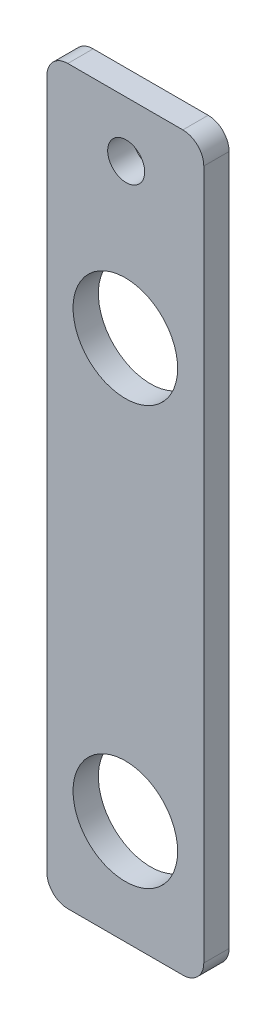
ISO-10303-21;
HEADER;
FILE_DESCRIPTION(('STEP AP214'),'2;1');
FILE_NAME('part.step','',(''),(''),'','','');
FILE_SCHEMA(('AUTOMOTIVE_DESIGN { 1 0 10303 214 1 1 1 1 }'));
ENDSEC;
DATA;
#1=APPLICATION_CONTEXT('core data for automotive mechanical design processes');
#2=APPLICATION_PROTOCOL_DEFINITION('international standard','automotive_design',2000,#1);
#3=PRODUCT_CONTEXT('',#1,'mechanical');
#4=PRODUCT('Part','Part','',(#3));
#5=PRODUCT_RELATED_PRODUCT_CATEGORY('part','',(#4));
#6=PRODUCT_DEFINITION_FORMATION('','',#4);
#7=PRODUCT_DEFINITION_CONTEXT('part definition',#1,'design');
#8=PRODUCT_DEFINITION('design','',#6,#7);
#9=PRODUCT_DEFINITION_SHAPE('','',#8);
#10=(LENGTH_UNIT() NAMED_UNIT(*) SI_UNIT(.MILLI.,.METRE.));
#11=(NAMED_UNIT(*) PLANE_ANGLE_UNIT() SI_UNIT($,.RADIAN.));
#12=(NAMED_UNIT(*) SI_UNIT($,.STERADIAN.) SOLID_ANGLE_UNIT());
#13=UNCERTAINTY_MEASURE_WITH_UNIT(LENGTH_MEASURE(1.E-05),#10,'distance_accuracy_value','');
#14=(GEOMETRIC_REPRESENTATION_CONTEXT(3) GLOBAL_UNCERTAINTY_ASSIGNED_CONTEXT((#13)) GLOBAL_UNIT_ASSIGNED_CONTEXT((#10,
#11,#12)) REPRESENTATION_CONTEXT('',''));
#15=CARTESIAN_POINT('',(0.,0.,0.));
#16=DIRECTION('',(0.,0.,1.));
#17=DIRECTION('',(1.,0.,0.));
#18=AXIS2_PLACEMENT_3D('',#15,#16,#17);
#19=CARTESIAN_POINT('',(0.,0.,3.0734));
#20=DIRECTION('',(0.,0.,-1.));
#21=DIRECTION('',(-1.,0.,0.));
#22=AXIS2_PLACEMENT_3D('',#19,#20,#21);
#23=PLANE('',#22);
#24=CARTESIAN_POINT('',(9.62745805929899,82.1563,3.0734));
#25=DIRECTION('',(0.,0.,1.));
#26=DIRECTION('',(1.,0.,0.));
#27=AXIS2_PLACEMENT_3D('',#24,#25,#26);
#28=CIRCLE('',#27,2.2479);
#29=CARTESIAN_POINT('',(11.875358059299,82.1563,3.0734));
#30=VERTEX_POINT('',#29);
#31=EDGE_CURVE('E193',#30,#30,#28,.T.);
#32=ORIENTED_EDGE('',*,*,#31,.F.);
#33=EDGE_LOOP('',(#32));
#34=FACE_BOUND('',#33,.T.);
#35=DIRECTION('',(0.,-1.,0.));
#36=VECTOR('',#35,1.);
#37=CARTESIAN_POINT('',(0.,0.,3.0734));
#38=LINE('',#37,#36);
#39=CARTESIAN_POINT('',(0.,86.36,3.0734));
#40=VERTEX_POINT('',#39);
#41=CARTESIAN_POINT('',(0.,2.54,3.0734));
#42=VERTEX_POINT('',#41);
#43=EDGE_CURVE('E139',#40,#42,#38,.T.);
#44=ORIENTED_EDGE('',*,*,#43,.T.);
#45=CARTESIAN_POINT('',(2.54,2.54,3.0734));
#46=DIRECTION('',(0.,0.,-1.));
#47=DIRECTION('',(-1.,0.,0.));
#48=AXIS2_PLACEMENT_3D('',#45,#46,#47);
#49=CIRCLE('',#48,2.54);
#50=CARTESIAN_POINT('',(2.54,0.,3.0734));
#51=VERTEX_POINT('',#50);
#52=EDGE_CURVE('E154',#42,#51,#49,.F.);
#53=ORIENTED_EDGE('',*,*,#52,.T.);
#54=DIRECTION('',(1.,0.,0.));
#55=VECTOR('',#54,1.);
#56=CARTESIAN_POINT('',(0.,0.,3.0734));
#57=LINE('',#56,#55);
#58=CARTESIAN_POINT('',(16.51,0.,3.0734));
#59=VERTEX_POINT('',#58);
#60=EDGE_CURVE('E121',#51,#59,#57,.T.);
#61=ORIENTED_EDGE('',*,*,#60,.T.);
#62=CARTESIAN_POINT('',(16.51,2.54,3.0734));
#63=DIRECTION('',(0.,0.,-1.));
#64=DIRECTION('',(-1.,0.,0.));
#65=AXIS2_PLACEMENT_3D('',#62,#63,#64);
#66=CIRCLE('',#65,2.54);
#67=CARTESIAN_POINT('',(19.05,2.54,3.0734));
#68=VERTEX_POINT('',#67);
#69=EDGE_CURVE('E152',#59,#68,#66,.F.);
#70=ORIENTED_EDGE('',*,*,#69,.T.);
#71=DIRECTION('',(0.,1.,0.));
#72=VECTOR('',#71,1.);
#73=CARTESIAN_POINT('',(19.05,0.,3.0734));
#74=LINE('',#73,#72);
#75=CARTESIAN_POINT('',(19.05,86.36,3.0734));
#76=VERTEX_POINT('',#75);
#77=EDGE_CURVE('E165',#68,#76,#74,.T.);
#78=ORIENTED_EDGE('',*,*,#77,.T.);
#79=CARTESIAN_POINT('',(16.51,86.36,3.0734));
#80=DIRECTION('',(0.,0.,-1.));
#81=DIRECTION('',(-1.,0.,0.));
#82=AXIS2_PLACEMENT_3D('',#79,#80,#81);
#83=CIRCLE('',#82,2.54);
#84=CARTESIAN_POINT('',(16.51,88.9,3.0734));
#85=VERTEX_POINT('',#84);
#86=EDGE_CURVE('E56',#76,#85,#83,.F.);
#87=ORIENTED_EDGE('',*,*,#86,.T.);
#88=DIRECTION('',(-1.,0.,0.));
#89=VECTOR('',#88,1.);
#90=CARTESIAN_POINT('',(0.,88.9,3.0734));
#91=LINE('',#90,#89);
#92=CARTESIAN_POINT('',(2.54,88.9,3.0734));
#93=VERTEX_POINT('',#92);
#94=EDGE_CURVE('E140',#85,#93,#91,.T.);
#95=ORIENTED_EDGE('',*,*,#94,.T.);
#96=CARTESIAN_POINT('',(2.54,86.36,3.0734));
#97=DIRECTION('',(0.,0.,-1.));
#98=DIRECTION('',(-1.,0.,0.));
#99=AXIS2_PLACEMENT_3D('',#96,#97,#98);
#100=CIRCLE('',#99,2.54);
#101=EDGE_CURVE('E149',#93,#40,#100,.F.);
#102=ORIENTED_EDGE('',*,*,#101,.T.);
#103=EDGE_LOOP('',(#44,#53,#61,#70,#78,#87,#95,#102));
#104=FACE_BOUND('',#103,.T.);
#105=CARTESIAN_POINT('',(9.525,12.7,3.0734));
#106=DIRECTION('',(0.,0.,1.));
#107=DIRECTION('',(1.,0.,0.));
#108=AXIS2_PLACEMENT_3D('',#105,#106,#107);
#109=CIRCLE('',#108,6.35);
#110=CARTESIAN_POINT('',(15.875,12.7,3.0734));
#111=VERTEX_POINT('',#110);
#112=EDGE_CURVE('E134',#111,#111,#109,.T.);
#113=ORIENTED_EDGE('',*,*,#112,.F.);
#114=EDGE_LOOP('',(#113));
#115=FACE_BOUND('',#114,.T.);
#116=CARTESIAN_POINT('',(9.525,63.5,3.0734));
#117=DIRECTION('',(0.,0.,1.));
#118=DIRECTION('',(1.,0.,0.));
#119=AXIS2_PLACEMENT_3D('',#116,#117,#118);
#120=CIRCLE('',#119,6.35);
#121=CARTESIAN_POINT('',(15.875,63.5,3.0734));
#122=VERTEX_POINT('',#121);
#123=EDGE_CURVE('E182',#122,#122,#120,.T.);
#124=ORIENTED_EDGE('',*,*,#123,.F.);
#125=EDGE_LOOP('',(#124));
#126=FACE_BOUND('',#125,.T.);
#127=ADVANCED_FACE('F35',(#34,#104,#115,#126),#23,.F.);
#128=CARTESIAN_POINT('',(0.,0.,0.));
#129=DIRECTION('',(0.,0.,-1.));
#130=DIRECTION('',(-1.,0.,0.));
#131=AXIS2_PLACEMENT_3D('',#128,#129,#130);
#132=PLANE('',#131);
#133=CARTESIAN_POINT('',(9.62745805929899,82.1563,0.));
#134=DIRECTION('',(0.,0.,1.));
#135=DIRECTION('',(1.,0.,0.));
#136=AXIS2_PLACEMENT_3D('',#133,#134,#135);
#137=CIRCLE('',#136,2.2479);
#138=CARTESIAN_POINT('',(11.875358059299,82.1563,0.));
#139=VERTEX_POINT('',#138);
#140=EDGE_CURVE('E188',#139,#139,#137,.T.);
#141=ORIENTED_EDGE('',*,*,#140,.T.);
#142=EDGE_LOOP('',(#141));
#143=FACE_BOUND('',#142,.T.);
#144=CARTESIAN_POINT('',(9.525,12.7,0.));
#145=DIRECTION('',(0.,0.,1.));
#146=DIRECTION('',(1.,0.,0.));
#147=AXIS2_PLACEMENT_3D('',#144,#145,#146);
#148=CIRCLE('',#147,6.35);
#149=CARTESIAN_POINT('',(15.875,12.7,0.));
#150=VERTEX_POINT('',#149);
#151=EDGE_CURVE('E179',#150,#150,#148,.T.);
#152=ORIENTED_EDGE('',*,*,#151,.T.);
#153=EDGE_LOOP('',(#152));
#154=FACE_BOUND('',#153,.T.);
#155=DIRECTION('',(1.,0.,0.));
#156=VECTOR('',#155,1.);
#157=CARTESIAN_POINT('',(0.,0.,0.));
#158=LINE('',#157,#156);
#159=CARTESIAN_POINT('',(2.54,0.,0.));
#160=VERTEX_POINT('',#159);
#161=CARTESIAN_POINT('',(16.51,0.,0.));
#162=VERTEX_POINT('',#161);
#163=EDGE_CURVE('E118',#160,#162,#158,.T.);
#164=ORIENTED_EDGE('',*,*,#163,.F.);
#165=CARTESIAN_POINT('',(2.54,2.54,0.));
#166=DIRECTION('',(0.,0.,-1.));
#167=DIRECTION('',(-1.,0.,0.));
#168=AXIS2_PLACEMENT_3D('',#165,#166,#167);
#169=CIRCLE('',#168,2.54);
#170=CARTESIAN_POINT('',(0.,2.54,0.));
#171=VERTEX_POINT('',#170);
#172=EDGE_CURVE('E101',#160,#171,#169,.T.);
#173=ORIENTED_EDGE('',*,*,#172,.T.);
#174=DIRECTION('',(0.,-1.,0.));
#175=VECTOR('',#174,1.);
#176=CARTESIAN_POINT('',(0.,0.,0.));
#177=LINE('',#176,#175);
#178=CARTESIAN_POINT('',(0.,86.36,0.));
#179=VERTEX_POINT('',#178);
#180=EDGE_CURVE('E129',#179,#171,#177,.T.);
#181=ORIENTED_EDGE('',*,*,#180,.F.);
#182=CARTESIAN_POINT('',(2.54,86.36,0.));
#183=DIRECTION('',(0.,0.,-1.));
#184=DIRECTION('',(-1.,0.,0.));
#185=AXIS2_PLACEMENT_3D('',#182,#183,#184);
#186=CIRCLE('',#185,2.54);
#187=CARTESIAN_POINT('',(2.54,88.9,0.));
#188=VERTEX_POINT('',#187);
#189=EDGE_CURVE('E122',#179,#188,#186,.T.);
#190=ORIENTED_EDGE('',*,*,#189,.T.);
#191=DIRECTION('',(-1.,0.,0.));
#192=VECTOR('',#191,1.);
#193=CARTESIAN_POINT('',(0.,88.9,0.));
#194=LINE('',#193,#192);
#195=CARTESIAN_POINT('',(16.51,88.9,0.));
#196=VERTEX_POINT('',#195);
#197=EDGE_CURVE('E132',#196,#188,#194,.T.);
#198=ORIENTED_EDGE('',*,*,#197,.F.);
#199=CARTESIAN_POINT('',(16.51,86.36,0.));
#200=DIRECTION('',(0.,0.,-1.));
#201=DIRECTION('',(-1.,0.,0.));
#202=AXIS2_PLACEMENT_3D('',#199,#200,#201);
#203=CIRCLE('',#202,2.54);
#204=CARTESIAN_POINT('',(19.05,86.36,0.));
#205=VERTEX_POINT('',#204);
#206=EDGE_CURVE('E143',#196,#205,#203,.T.);
#207=ORIENTED_EDGE('',*,*,#206,.T.);
#208=DIRECTION('',(0.,1.,0.));
#209=VECTOR('',#208,1.);
#210=CARTESIAN_POINT('',(19.05,0.,0.));
#211=LINE('',#210,#209);
#212=CARTESIAN_POINT('',(19.05,2.54,0.));
#213=VERTEX_POINT('',#212);
#214=EDGE_CURVE('E128',#213,#205,#211,.T.);
#215=ORIENTED_EDGE('',*,*,#214,.F.);
#216=CARTESIAN_POINT('',(16.51,2.54,0.));
#217=DIRECTION('',(0.,0.,-1.));
#218=DIRECTION('',(-1.,0.,0.));
#219=AXIS2_PLACEMENT_3D('',#216,#217,#218);
#220=CIRCLE('',#219,2.54);
#221=EDGE_CURVE('E112',#213,#162,#220,.T.);
#222=ORIENTED_EDGE('',*,*,#221,.T.);
#223=EDGE_LOOP('',(#164,#173,#181,#190,#198,#207,#215,#222));
#224=FACE_BOUND('',#223,.T.);
#225=CARTESIAN_POINT('',(9.525,63.5,0.));
#226=DIRECTION('',(0.,0.,1.));
#227=DIRECTION('',(1.,0.,0.));
#228=AXIS2_PLACEMENT_3D('',#225,#226,#227);
#229=CIRCLE('',#228,6.35);
#230=CARTESIAN_POINT('',(15.875,63.5,0.));
#231=VERTEX_POINT('',#230);
#232=EDGE_CURVE('E185',#231,#231,#229,.T.);
#233=ORIENTED_EDGE('',*,*,#232,.T.);
#234=EDGE_LOOP('',(#233));
#235=FACE_BOUND('',#234,.T.);
#236=ADVANCED_FACE('F125',(#143,#154,#224,#235),#132,.T.);
#237=CARTESIAN_POINT('',(0.,0.,3.0734));
#238=DIRECTION('',(1.,0.,0.));
#239=DIRECTION('',(0.,0.,-1.));
#240=AXIS2_PLACEMENT_3D('',#237,#238,#239);
#241=PLANE('',#240);
#242=ORIENTED_EDGE('',*,*,#180,.T.);
#243=DIRECTION('',(0.,0.,-1.));
#244=VECTOR('',#243,1.);
#245=CARTESIAN_POINT('',(0.,2.54,3.0734));
#246=LINE('',#245,#244);
#247=EDGE_CURVE('E106',#171,#42,#246,.F.);
#248=ORIENTED_EDGE('',*,*,#247,.T.);
#249=ORIENTED_EDGE('',*,*,#43,.F.);
#250=DIRECTION('',(0.,0.,-1.));
#251=VECTOR('',#250,1.);
#252=CARTESIAN_POINT('',(0.,86.36,3.0734));
#253=LINE('',#252,#251);
#254=EDGE_CURVE('E111',#40,#179,#253,.T.);
#255=ORIENTED_EDGE('',*,*,#254,.T.);
#256=EDGE_LOOP('',(#242,#248,#249,#255));
#257=FACE_BOUND('',#256,.T.);
#258=ADVANCED_FACE('F214',(#257),#241,.F.);
#259=CARTESIAN_POINT('',(0.,0.,3.0734));
#260=DIRECTION('',(0.,1.,0.));
#261=DIRECTION('',(0.,0.,1.));
#262=AXIS2_PLACEMENT_3D('',#259,#260,#261);
#263=PLANE('',#262);
#264=ORIENTED_EDGE('',*,*,#60,.F.);
#265=DIRECTION('',(0.,0.,-1.));
#266=VECTOR('',#265,1.);
#267=CARTESIAN_POINT('',(2.54,0.,3.0734));
#268=LINE('',#267,#266);
#269=EDGE_CURVE('E105',#51,#160,#268,.T.);
#270=ORIENTED_EDGE('',*,*,#269,.T.);
#271=ORIENTED_EDGE('',*,*,#163,.T.);
#272=DIRECTION('',(0.,0.,-1.));
#273=VECTOR('',#272,1.);
#274=CARTESIAN_POINT('',(16.51,0.,3.0734));
#275=LINE('',#274,#273);
#276=EDGE_CURVE('E123',#162,#59,#275,.F.);
#277=ORIENTED_EDGE('',*,*,#276,.T.);
#278=EDGE_LOOP('',(#264,#270,#271,#277));
#279=FACE_BOUND('',#278,.T.);
#280=ADVANCED_FACE('F117',(#279),#263,.F.);
#281=CARTESIAN_POINT('',(19.05,0.,3.0734));
#282=DIRECTION('',(-1.,0.,0.));
#283=DIRECTION('',(0.,0.,1.));
#284=AXIS2_PLACEMENT_3D('',#281,#282,#283);
#285=PLANE('',#284);
#286=ORIENTED_EDGE('',*,*,#77,.F.);
#287=DIRECTION('',(0.,0.,-1.));
#288=VECTOR('',#287,1.);
#289=CARTESIAN_POINT('',(19.05,2.54,3.0734));
#290=LINE('',#289,#288);
#291=EDGE_CURVE('E158',#68,#213,#290,.T.);
#292=ORIENTED_EDGE('',*,*,#291,.T.);
#293=ORIENTED_EDGE('',*,*,#214,.T.);
#294=DIRECTION('',(0.,0.,-1.));
#295=VECTOR('',#294,1.);
#296=CARTESIAN_POINT('',(19.05,86.36,3.0734));
#297=LINE('',#296,#295);
#298=EDGE_CURVE('E156',#205,#76,#297,.F.);
#299=ORIENTED_EDGE('',*,*,#298,.T.);
#300=EDGE_LOOP('',(#286,#292,#293,#299));
#301=FACE_BOUND('',#300,.T.);
#302=ADVANCED_FACE('F163',(#301),#285,.F.);
#303=CARTESIAN_POINT('',(0.,88.9,3.0734));
#304=DIRECTION('',(0.,-1.,0.));
#305=DIRECTION('',(0.,0.,-1.));
#306=AXIS2_PLACEMENT_3D('',#303,#304,#305);
#307=PLANE('',#306);
#308=ORIENTED_EDGE('',*,*,#94,.F.);
#309=DIRECTION('',(0.,0.,-1.));
#310=VECTOR('',#309,1.);
#311=CARTESIAN_POINT('',(16.51,88.9,3.0734));
#312=LINE('',#311,#310);
#313=EDGE_CURVE('E11',#85,#196,#312,.T.);
#314=ORIENTED_EDGE('',*,*,#313,.T.);
#315=ORIENTED_EDGE('',*,*,#197,.T.);
#316=DIRECTION('',(0.,0.,-1.));
#317=VECTOR('',#316,1.);
#318=CARTESIAN_POINT('',(2.54,88.9,3.0734));
#319=LINE('',#318,#317);
#320=EDGE_CURVE('E43',#188,#93,#319,.F.);
#321=ORIENTED_EDGE('',*,*,#320,.T.);
#322=EDGE_LOOP('',(#308,#314,#315,#321));
#323=FACE_BOUND('',#322,.T.);
#324=ADVANCED_FACE('F172',(#323),#307,.F.);
#325=CARTESIAN_POINT('',(9.525,12.7,3.0734));
#326=DIRECTION('',(0.,0.,-1.));
#327=DIRECTION('',(-1.,0.,0.));
#328=AXIS2_PLACEMENT_3D('',#325,#326,#327);
#329=CYLINDRICAL_SURFACE('',#328,6.35);
#330=ORIENTED_EDGE('',*,*,#112,.T.);
#331=EDGE_LOOP('',(#330));
#332=FACE_BOUND('',#331,.T.);
#333=ORIENTED_EDGE('',*,*,#151,.F.);
#334=EDGE_LOOP('',(#333));
#335=FACE_BOUND('',#334,.T.);
#336=ADVANCED_FACE('F210',(#332,#335),#329,.F.);
#337=CARTESIAN_POINT('',(9.525,63.5,3.0734));
#338=DIRECTION('',(0.,0.,-1.));
#339=DIRECTION('',(-1.,0.,0.));
#340=AXIS2_PLACEMENT_3D('',#337,#338,#339);
#341=CYLINDRICAL_SURFACE('',#340,6.35);
#342=ORIENTED_EDGE('',*,*,#123,.T.);
#343=EDGE_LOOP('',(#342));
#344=FACE_BOUND('',#343,.T.);
#345=ORIENTED_EDGE('',*,*,#232,.F.);
#346=EDGE_LOOP('',(#345));
#347=FACE_BOUND('',#346,.T.);
#348=ADVANCED_FACE('F207',(#344,#347),#341,.F.);
#349=CARTESIAN_POINT('',(9.62745805929899,82.1563,3.0734));
#350=DIRECTION('',(0.,0.,1.));
#351=DIRECTION('',(1.,0.,0.));
#352=AXIS2_PLACEMENT_3D('',#349,#350,#351);
#353=CYLINDRICAL_SURFACE('',#352,2.2479);
#354=ORIENTED_EDGE('',*,*,#140,.F.);
#355=EDGE_LOOP('',(#354));
#356=FACE_BOUND('',#355,.T.);
#357=ORIENTED_EDGE('',*,*,#31,.T.);
#358=EDGE_LOOP('',(#357));
#359=FACE_BOUND('',#358,.T.);
#360=ADVANCED_FACE('F197',(#356,#359),#353,.F.);
#361=CARTESIAN_POINT('',(2.54,2.54,3.0734));
#362=DIRECTION('',(0.,0.,-1.));
#363=DIRECTION('',(-1.,0.,0.));
#364=AXIS2_PLACEMENT_3D('',#361,#362,#363);
#365=CYLINDRICAL_SURFACE('',#364,2.54);
#366=ORIENTED_EDGE('',*,*,#52,.F.);
#367=ORIENTED_EDGE('',*,*,#247,.F.);
#368=ORIENTED_EDGE('',*,*,#172,.F.);
#369=ORIENTED_EDGE('',*,*,#269,.F.);
#370=EDGE_LOOP('',(#366,#367,#368,#369));
#371=FACE_BOUND('',#370,.T.);
#372=ADVANCED_FACE('F104',(#371),#365,.T.);
#373=CARTESIAN_POINT('',(16.51,2.54,3.0734));
#374=DIRECTION('',(0.,0.,-1.));
#375=DIRECTION('',(-1.,0.,0.));
#376=AXIS2_PLACEMENT_3D('',#373,#374,#375);
#377=CYLINDRICAL_SURFACE('',#376,2.54);
#378=ORIENTED_EDGE('',*,*,#69,.F.);
#379=ORIENTED_EDGE('',*,*,#276,.F.);
#380=ORIENTED_EDGE('',*,*,#221,.F.);
#381=ORIENTED_EDGE('',*,*,#291,.F.);
#382=EDGE_LOOP('',(#378,#379,#380,#381));
#383=FACE_BOUND('',#382,.T.);
#384=ADVANCED_FACE('F233',(#383),#377,.T.);
#385=CARTESIAN_POINT('',(16.51,86.36,3.0734));
#386=DIRECTION('',(0.,0.,-1.));
#387=DIRECTION('',(-1.,0.,0.));
#388=AXIS2_PLACEMENT_3D('',#385,#386,#387);
#389=CYLINDRICAL_SURFACE('',#388,2.54);
#390=ORIENTED_EDGE('',*,*,#86,.F.);
#391=ORIENTED_EDGE('',*,*,#298,.F.);
#392=ORIENTED_EDGE('',*,*,#206,.F.);
#393=ORIENTED_EDGE('',*,*,#313,.F.);
#394=EDGE_LOOP('',(#390,#391,#392,#393));
#395=FACE_BOUND('',#394,.T.);
#396=ADVANCED_FACE('F171',(#395),#389,.T.);
#397=CARTESIAN_POINT('',(2.54,86.36,3.0734));
#398=DIRECTION('',(0.,0.,-1.));
#399=DIRECTION('',(-1.,0.,0.));
#400=AXIS2_PLACEMENT_3D('',#397,#398,#399);
#401=CYLINDRICAL_SURFACE('',#400,2.54);
#402=ORIENTED_EDGE('',*,*,#101,.F.);
#403=ORIENTED_EDGE('',*,*,#320,.F.);
#404=ORIENTED_EDGE('',*,*,#189,.F.);
#405=ORIENTED_EDGE('',*,*,#254,.F.);
#406=EDGE_LOOP('',(#402,#403,#404,#405));
#407=FACE_BOUND('',#406,.T.);
#408=ADVANCED_FACE('F37',(#407),#401,.T.);
#409=CLOSED_SHELL('',(#127,#236,#258,#280,#302,#324,#336,#348,#360,#372,#384,#396,#408));
#410=MANIFOLD_SOLID_BREP('B2',#409);
#411=ADVANCED_BREP_SHAPE_REPRESENTATION('',(#18,#410),#14);
#412=SHAPE_DEFINITION_REPRESENTATION(#9,#411);
ENDSEC;
END-ISO-10303-21;
